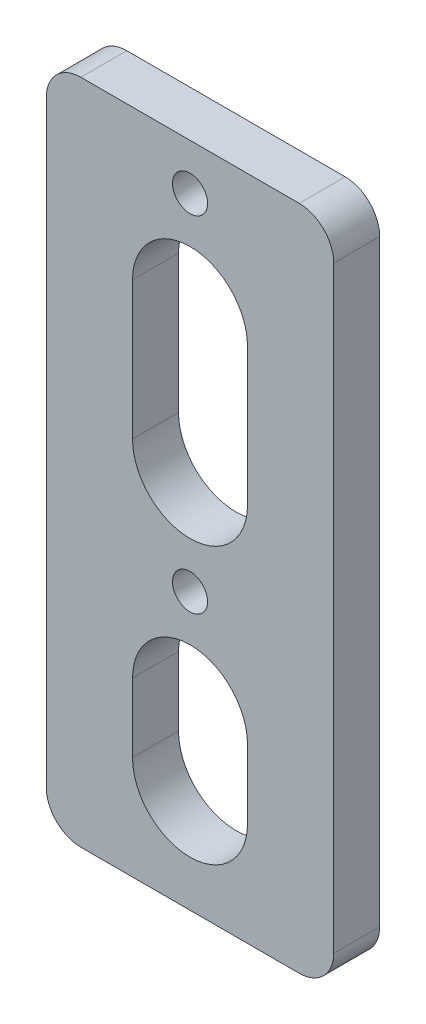
ISO-10303-21;
HEADER;
FILE_DESCRIPTION(('STEP AP214'),'2;1');
FILE_NAME('part.step','',(''),(''),'','','');
FILE_SCHEMA(('AUTOMOTIVE_DESIGN { 1 0 10303 214 1 1 1 1 }'));
ENDSEC;
DATA;
#1=APPLICATION_CONTEXT('core data for automotive mechanical design processes');
#2=APPLICATION_PROTOCOL_DEFINITION('international standard','automotive_design',2000,#1);
#3=PRODUCT_CONTEXT('',#1,'mechanical');
#4=PRODUCT('Part','Part','',(#3));
#5=PRODUCT_RELATED_PRODUCT_CATEGORY('part','',(#4));
#6=PRODUCT_DEFINITION_FORMATION('','',#4);
#7=PRODUCT_DEFINITION_CONTEXT('part definition',#1,'design');
#8=PRODUCT_DEFINITION('design','',#6,#7);
#9=PRODUCT_DEFINITION_SHAPE('','',#8);
#10=(LENGTH_UNIT() NAMED_UNIT(*) SI_UNIT(.MILLI.,.METRE.));
#11=(NAMED_UNIT(*) PLANE_ANGLE_UNIT() SI_UNIT($,.RADIAN.));
#12=(NAMED_UNIT(*) SI_UNIT($,.STERADIAN.) SOLID_ANGLE_UNIT());
#13=UNCERTAINTY_MEASURE_WITH_UNIT(LENGTH_MEASURE(1.E-05),#10,'distance_accuracy_value','');
#14=(GEOMETRIC_REPRESENTATION_CONTEXT(3) GLOBAL_UNCERTAINTY_ASSIGNED_CONTEXT((#13)) GLOBAL_UNIT_ASSIGNED_CONTEXT((#10,
#11,#12)) REPRESENTATION_CONTEXT('',''));
#15=CARTESIAN_POINT('',(0.,0.,0.));
#16=DIRECTION('',(0.,0.,1.));
#17=DIRECTION('',(1.,0.,0.));
#18=AXIS2_PLACEMENT_3D('',#15,#16,#17);
#19=CARTESIAN_POINT('',(12.5,-29.,4.));
#20=DIRECTION('',(-1.,0.,0.));
#21=DIRECTION('',(0.,0.,1.));
#22=AXIS2_PLACEMENT_3D('',#19,#20,#21);
#23=PLANE('',#22);
#24=DIRECTION('',(0.,1.,0.));
#25=VECTOR('',#24,1.);
#26=CARTESIAN_POINT('',(12.5,-29.,4.));
#27=LINE('',#26,#25);
#28=CARTESIAN_POINT('',(12.5,-26.,4.));
#29=VERTEX_POINT('',#28);
#30=CARTESIAN_POINT('',(12.5,26.,4.));
#31=VERTEX_POINT('',#30);
#32=EDGE_CURVE('E231',#29,#31,#27,.T.);
#33=ORIENTED_EDGE('',*,*,#32,.F.);
#34=DIRECTION('',(0.,0.,-1.));
#35=VECTOR('',#34,1.);
#36=CARTESIAN_POINT('',(12.5,-26.,4.));
#37=LINE('',#36,#35);
#38=CARTESIAN_POINT('',(12.5,-26.,0.));
#39=VERTEX_POINT('',#38);
#40=EDGE_CURVE('E256',#29,#39,#37,.T.);
#41=ORIENTED_EDGE('',*,*,#40,.T.);
#42=DIRECTION('',(0.,1.,0.));
#43=VECTOR('',#42,1.);
#44=CARTESIAN_POINT('',(12.5,-29.,0.));
#45=LINE('',#44,#43);
#46=CARTESIAN_POINT('',(12.5,26.,0.));
#47=VERTEX_POINT('',#46);
#48=EDGE_CURVE('E222',#39,#47,#45,.T.);
#49=ORIENTED_EDGE('',*,*,#48,.T.);
#50=DIRECTION('',(0.,0.,-1.));
#51=VECTOR('',#50,1.);
#52=CARTESIAN_POINT('',(12.5,26.,4.));
#53=LINE('',#52,#51);
#54=EDGE_CURVE('E244',#47,#31,#53,.F.);
#55=ORIENTED_EDGE('',*,*,#54,.T.);
#56=EDGE_LOOP('',(#33,#41,#49,#55));
#57=FACE_BOUND('',#56,.T.);
#58=ADVANCED_FACE('F36',(#57),#23,.F.);
#59=CARTESIAN_POINT('',(-12.5,29.,4.));
#60=DIRECTION('',(0.,-1.,0.));
#61=DIRECTION('',(0.,0.,-1.));
#62=AXIS2_PLACEMENT_3D('',#59,#60,#61);
#63=PLANE('',#62);
#64=DIRECTION('',(-1.,0.,0.));
#65=VECTOR('',#64,1.);
#66=CARTESIAN_POINT('',(-12.5,29.,4.));
#67=LINE('',#66,#65);
#68=CARTESIAN_POINT('',(9.5,29.,4.));
#69=VERTEX_POINT('',#68);
#70=CARTESIAN_POINT('',(-9.5,29.,4.));
#71=VERTEX_POINT('',#70);
#72=EDGE_CURVE('E234',#69,#71,#67,.T.);
#73=ORIENTED_EDGE('',*,*,#72,.F.);
#74=DIRECTION('',(0.,0.,-1.));
#75=VECTOR('',#74,1.);
#76=CARTESIAN_POINT('',(9.5,29.,4.));
#77=LINE('',#76,#75);
#78=CARTESIAN_POINT('',(9.5,29.,0.));
#79=VERTEX_POINT('',#78);
#80=EDGE_CURVE('E11',#69,#79,#77,.T.);
#81=ORIENTED_EDGE('',*,*,#80,.T.);
#82=DIRECTION('',(-1.,0.,0.));
#83=VECTOR('',#82,1.);
#84=CARTESIAN_POINT('',(-12.5,29.,0.));
#85=LINE('',#84,#83);
#86=CARTESIAN_POINT('',(-9.5,29.,0.));
#87=VERTEX_POINT('',#86);
#88=EDGE_CURVE('E247',#79,#87,#85,.T.);
#89=ORIENTED_EDGE('',*,*,#88,.T.);
#90=DIRECTION('',(0.,0.,-1.));
#91=VECTOR('',#90,1.);
#92=CARTESIAN_POINT('',(-9.5,29.,4.));
#93=LINE('',#92,#91);
#94=EDGE_CURVE('E44',#87,#71,#93,.F.);
#95=ORIENTED_EDGE('',*,*,#94,.T.);
#96=EDGE_LOOP('',(#73,#81,#89,#95));
#97=FACE_BOUND('',#96,.T.);
#98=ADVANCED_FACE('F287',(#97),#63,.F.);
#99=CARTESIAN_POINT('',(-12.5,-29.,4.));
#100=DIRECTION('',(1.,0.,0.));
#101=DIRECTION('',(0.,0.,-1.));
#102=AXIS2_PLACEMENT_3D('',#99,#100,#101);
#103=PLANE('',#102);
#104=DIRECTION('',(0.,-1.,0.));
#105=VECTOR('',#104,1.);
#106=CARTESIAN_POINT('',(-12.5,-29.,0.));
#107=LINE('',#106,#105);
#108=CARTESIAN_POINT('',(-12.5,26.,0.));
#109=VERTEX_POINT('',#108);
#110=CARTESIAN_POINT('',(-12.5,-26.,0.));
#111=VERTEX_POINT('',#110);
#112=EDGE_CURVE('E250',#109,#111,#107,.T.);
#113=ORIENTED_EDGE('',*,*,#112,.T.);
#114=DIRECTION('',(0.,0.,-1.));
#115=VECTOR('',#114,1.);
#116=CARTESIAN_POINT('',(-12.5,-26.,4.));
#117=LINE('',#116,#115);
#118=CARTESIAN_POINT('',(-12.5,-26.,4.));
#119=VERTEX_POINT('',#118);
#120=EDGE_CURVE('E283',#111,#119,#117,.F.);
#121=ORIENTED_EDGE('',*,*,#120,.T.);
#122=DIRECTION('',(0.,-1.,0.));
#123=VECTOR('',#122,1.);
#124=CARTESIAN_POINT('',(-12.5,-29.,4.));
#125=LINE('',#124,#123);
#126=CARTESIAN_POINT('',(-12.5,26.,4.));
#127=VERTEX_POINT('',#126);
#128=EDGE_CURVE('E238',#127,#119,#125,.T.);
#129=ORIENTED_EDGE('',*,*,#128,.F.);
#130=DIRECTION('',(0.,0.,-1.));
#131=VECTOR('',#130,1.);
#132=CARTESIAN_POINT('',(-12.5,26.,4.));
#133=LINE('',#132,#131);
#134=EDGE_CURVE('E280',#127,#109,#133,.T.);
#135=ORIENTED_EDGE('',*,*,#134,.T.);
#136=EDGE_LOOP('',(#113,#121,#129,#135));
#137=FACE_BOUND('',#136,.T.);
#138=ADVANCED_FACE('F299',(#137),#103,.F.);
#139=CARTESIAN_POINT('',(-12.5,-29.,4.));
#140=DIRECTION('',(0.,1.,0.));
#141=DIRECTION('',(0.,0.,1.));
#142=AXIS2_PLACEMENT_3D('',#139,#140,#141);
#143=PLANE('',#142);
#144=DIRECTION('',(1.,0.,0.));
#145=VECTOR('',#144,1.);
#146=CARTESIAN_POINT('',(-12.5,-29.,0.));
#147=LINE('',#146,#145);
#148=CARTESIAN_POINT('',(-9.5,-29.,0.));
#149=VERTEX_POINT('',#148);
#150=CARTESIAN_POINT('',(9.5,-29.,0.));
#151=VERTEX_POINT('',#150);
#152=EDGE_CURVE('E235',#149,#151,#147,.T.);
#153=ORIENTED_EDGE('',*,*,#152,.T.);
#154=DIRECTION('',(0.,0.,-1.));
#155=VECTOR('',#154,1.);
#156=CARTESIAN_POINT('',(9.5,-29.,4.));
#157=LINE('',#156,#155);
#158=CARTESIAN_POINT('',(9.5,-29.,4.));
#159=VERTEX_POINT('',#158);
#160=EDGE_CURVE('E270',#151,#159,#157,.F.);
#161=ORIENTED_EDGE('',*,*,#160,.T.);
#162=DIRECTION('',(1.,0.,0.));
#163=VECTOR('',#162,1.);
#164=CARTESIAN_POINT('',(-12.5,-29.,4.));
#165=LINE('',#164,#163);
#166=CARTESIAN_POINT('',(-9.5,-29.,4.));
#167=VERTEX_POINT('',#166);
#168=EDGE_CURVE('E241',#167,#159,#165,.T.);
#169=ORIENTED_EDGE('',*,*,#168,.F.);
#170=DIRECTION('',(0.,0.,-1.));
#171=VECTOR('',#170,1.);
#172=CARTESIAN_POINT('',(-9.5,-29.,4.));
#173=LINE('',#172,#171);
#174=EDGE_CURVE('E267',#167,#149,#173,.T.);
#175=ORIENTED_EDGE('',*,*,#174,.T.);
#176=EDGE_LOOP('',(#153,#161,#169,#175));
#177=FACE_BOUND('',#176,.T.);
#178=ADVANCED_FACE('F310',(#177),#143,.F.);
#179=CARTESIAN_POINT('',(0.,0.,4.));
#180=DIRECTION('',(0.,0.,-1.));
#181=DIRECTION('',(-1.,0.,0.));
#182=AXIS2_PLACEMENT_3D('',#179,#180,#181);
#183=PLANE('',#182);
#184=DIRECTION('',(0.,-1.,0.));
#185=VECTOR('',#184,1.);
#186=CARTESIAN_POINT('',(-5.00000000000002,15.9999999994988,4.));
#187=LINE('',#186,#185);
#188=CARTESIAN_POINT('',(-5.00000000000002,15.9999999994988,4.));
#189=VERTEX_POINT('',#188);
#190=CARTESIAN_POINT('',(-5.,3.99999999949883,4.));
#191=VERTEX_POINT('',#190);
#192=EDGE_CURVE('E179',#189,#191,#187,.T.);
#193=ORIENTED_EDGE('',*,*,#192,.F.);
#194=CARTESIAN_POINT('',(0.,15.9999999994988,4.));
#195=DIRECTION('',(0.,0.,1.));
#196=DIRECTION('',(1.,0.,0.));
#197=AXIS2_PLACEMENT_3D('',#194,#195,#196);
#198=CIRCLE('',#197,5.00000000000002);
#199=CARTESIAN_POINT('',(5.00000000000001,15.9999999994988,4.));
#200=VERTEX_POINT('',#199);
#201=EDGE_CURVE('E51',#200,#189,#198,.T.);
#202=ORIENTED_EDGE('',*,*,#201,.F.);
#203=DIRECTION('',(0.,1.,0.));
#204=VECTOR('',#203,1.);
#205=CARTESIAN_POINT('',(5.00000000000001,15.9999999994988,4.));
#206=LINE('',#205,#204);
#207=CARTESIAN_POINT('',(5.00000000000002,3.99999999949883,4.));
#208=VERTEX_POINT('',#207);
#209=EDGE_CURVE('E170',#208,#200,#206,.T.);
#210=ORIENTED_EDGE('',*,*,#209,.F.);
#211=CARTESIAN_POINT('',(0.,3.99999999949883,4.));
#212=DIRECTION('',(0.,0.,1.));
#213=DIRECTION('',(1.,0.,0.));
#214=AXIS2_PLACEMENT_3D('',#211,#212,#213);
#215=CIRCLE('',#214,5.00000000000002);
#216=EDGE_CURVE('E173',#191,#208,#215,.T.);
#217=ORIENTED_EDGE('',*,*,#216,.F.);
#218=EDGE_LOOP('',(#193,#202,#210,#217));
#219=FACE_BOUND('',#218,.T.);
#220=DIRECTION('',(0.,-1.,0.));
#221=VECTOR('',#220,1.);
#222=CARTESIAN_POINT('',(-4.99999999999969,-14.0000000002506,4.));
#223=LINE('',#222,#221);
#224=CARTESIAN_POINT('',(-4.99999999999969,-14.0000000002506,4.));
#225=VERTEX_POINT('',#224);
#226=CARTESIAN_POINT('',(-5.,-20.0000000002506,4.));
#227=VERTEX_POINT('',#226);
#228=EDGE_CURVE('E205',#225,#227,#223,.T.);
#229=ORIENTED_EDGE('',*,*,#228,.F.);
#230=CARTESIAN_POINT('',(-3.10231074483224E-13,-14.0000000002506,4.));
#231=DIRECTION('',(0.,0.,1.));
#232=DIRECTION('',(1.,0.,0.));
#233=AXIS2_PLACEMENT_3D('',#230,#231,#232);
#234=CIRCLE('',#233,4.99999999999969);
#235=CARTESIAN_POINT('',(4.99999999999969,-14.0000000002506,4.));
#236=VERTEX_POINT('',#235);
#237=EDGE_CURVE('E59',#236,#225,#234,.T.);
#238=ORIENTED_EDGE('',*,*,#237,.F.);
#239=DIRECTION('',(0.,1.,0.));
#240=VECTOR('',#239,1.);
#241=CARTESIAN_POINT('',(4.99999999999969,-14.0000000002506,4.));
#242=LINE('',#241,#240);
#243=CARTESIAN_POINT('',(4.99999999999969,-20.0000000002506,4.));
#244=VERTEX_POINT('',#243);
#245=EDGE_CURVE('E194',#244,#236,#242,.T.);
#246=ORIENTED_EDGE('',*,*,#245,.F.);
#247=CARTESIAN_POINT('',(-3.09863680443479E-13,-20.0000000002506,4.));
#248=DIRECTION('',(0.,0.,1.));
#249=DIRECTION('',(1.,0.,0.));
#250=AXIS2_PLACEMENT_3D('',#247,#248,#249);
#251=CIRCLE('',#250,4.99999999999969);
#252=EDGE_CURVE('E208',#227,#244,#251,.T.);
#253=ORIENTED_EDGE('',*,*,#252,.F.);
#254=EDGE_LOOP('',(#229,#238,#246,#253));
#255=FACE_BOUND('',#254,.T.);
#256=CARTESIAN_POINT('',(-2.52887956266378E-12,24.9999999994988,4.));
#257=DIRECTION('',(0.,0.,-1.));
#258=DIRECTION('',(-1.,0.,0.));
#259=AXIS2_PLACEMENT_3D('',#256,#257,#258);
#260=CIRCLE('',#259,1.5250000004891);
#261=CARTESIAN_POINT('',(-1.52500000049163,24.9999999994988,4.));
#262=VERTEX_POINT('',#261);
#263=EDGE_CURVE('E219',#262,#262,#260,.T.);
#264=ORIENTED_EDGE('',*,*,#263,.T.);
#265=EDGE_LOOP('',(#264));
#266=FACE_BOUND('',#265,.T.);
#267=CARTESIAN_POINT('',(-2.53208555920808E-12,-5.00000000050119,4.));
#268=DIRECTION('',(0.,0.,-1.));
#269=DIRECTION('',(-1.,0.,0.));
#270=AXIS2_PLACEMENT_3D('',#267,#268,#269);
#271=CIRCLE('',#270,1.5250000004891);
#272=CARTESIAN_POINT('',(-1.52500000049163,-5.00000000050119,4.));
#273=VERTEX_POINT('',#272);
#274=EDGE_CURVE('E226',#273,#273,#271,.T.);
#275=ORIENTED_EDGE('',*,*,#274,.T.);
#276=EDGE_LOOP('',(#275));
#277=FACE_BOUND('',#276,.T.);
#278=ORIENTED_EDGE('',*,*,#168,.T.);
#279=CARTESIAN_POINT('',(9.5,-26.,4.));
#280=DIRECTION('',(0.,0.,-1.));
#281=DIRECTION('',(-1.,0.,0.));
#282=AXIS2_PLACEMENT_3D('',#279,#280,#281);
#283=CIRCLE('',#282,3.);
#284=EDGE_CURVE('E278',#159,#29,#283,.F.);
#285=ORIENTED_EDGE('',*,*,#284,.T.);
#286=ORIENTED_EDGE('',*,*,#32,.T.);
#287=CARTESIAN_POINT('',(9.5,26.,4.));
#288=DIRECTION('',(0.,0.,-1.));
#289=DIRECTION('',(-1.,0.,0.));
#290=AXIS2_PLACEMENT_3D('',#287,#288,#289);
#291=CIRCLE('',#290,3.);
#292=EDGE_CURVE('E274',#31,#69,#291,.F.);
#293=ORIENTED_EDGE('',*,*,#292,.T.);
#294=ORIENTED_EDGE('',*,*,#72,.T.);
#295=CARTESIAN_POINT('',(-9.5,26.,4.));
#296=DIRECTION('',(0.,0.,-1.));
#297=DIRECTION('',(-1.,0.,0.));
#298=AXIS2_PLACEMENT_3D('',#295,#296,#297);
#299=CIRCLE('',#298,3.);
#300=EDGE_CURVE('E272',#71,#127,#299,.F.);
#301=ORIENTED_EDGE('',*,*,#300,.T.);
#302=ORIENTED_EDGE('',*,*,#128,.T.);
#303=CARTESIAN_POINT('',(-9.5,-26.,4.));
#304=DIRECTION('',(0.,0.,-1.));
#305=DIRECTION('',(-1.,0.,0.));
#306=AXIS2_PLACEMENT_3D('',#303,#304,#305);
#307=CIRCLE('',#306,3.);
#308=EDGE_CURVE('E276',#119,#167,#307,.F.);
#309=ORIENTED_EDGE('',*,*,#308,.T.);
#310=EDGE_LOOP('',(#278,#285,#286,#293,#294,#301,#302,#309));
#311=FACE_BOUND('',#310,.T.);
#312=ADVANCED_FACE('F293',(#219,#255,#266,#277,#311),#183,.F.);
#313=CARTESIAN_POINT('',(0.,0.,0.));
#314=DIRECTION('',(0.,0.,-1.));
#315=DIRECTION('',(-1.,0.,0.));
#316=AXIS2_PLACEMENT_3D('',#313,#314,#315);
#317=PLANE('',#316);
#318=CARTESIAN_POINT('',(0.,15.9999999994988,0.));
#319=DIRECTION('',(0.,0.,1.));
#320=DIRECTION('',(1.,0.,0.));
#321=AXIS2_PLACEMENT_3D('',#318,#319,#320);
#322=CIRCLE('',#321,5.00000000000002);
#323=CARTESIAN_POINT('',(5.00000000000001,15.9999999994988,0.));
#324=VERTEX_POINT('',#323);
#325=CARTESIAN_POINT('',(-5.00000000000002,15.9999999994988,0.));
#326=VERTEX_POINT('',#325);
#327=EDGE_CURVE('E151',#324,#326,#322,.T.);
#328=ORIENTED_EDGE('',*,*,#327,.T.);
#329=DIRECTION('',(0.,-1.,0.));
#330=VECTOR('',#329,1.);
#331=CARTESIAN_POINT('',(-5.00000000000002,15.9999999994988,0.));
#332=LINE('',#331,#330);
#333=CARTESIAN_POINT('',(-5.00000000000002,3.99999999949883,0.));
#334=VERTEX_POINT('',#333);
#335=EDGE_CURVE('E161',#326,#334,#332,.T.);
#336=ORIENTED_EDGE('',*,*,#335,.T.);
#337=CARTESIAN_POINT('',(0.,3.99999999949883,0.));
#338=DIRECTION('',(0.,0.,1.));
#339=DIRECTION('',(1.,0.,0.));
#340=AXIS2_PLACEMENT_3D('',#337,#338,#339);
#341=CIRCLE('',#340,5.00000000000002);
#342=CARTESIAN_POINT('',(5.00000000000002,3.99999999949883,0.));
#343=VERTEX_POINT('',#342);
#344=EDGE_CURVE('E165',#334,#343,#341,.T.);
#345=ORIENTED_EDGE('',*,*,#344,.T.);
#346=DIRECTION('',(0.,1.,0.));
#347=VECTOR('',#346,1.);
#348=CARTESIAN_POINT('',(5.00000000000001,15.9999999994988,0.));
#349=LINE('',#348,#347);
#350=EDGE_CURVE('E157',#343,#324,#349,.T.);
#351=ORIENTED_EDGE('',*,*,#350,.T.);
#352=EDGE_LOOP('',(#328,#336,#345,#351));
#353=FACE_BOUND('',#352,.T.);
#354=CARTESIAN_POINT('',(-3.10231074483224E-13,-14.0000000002506,0.));
#355=DIRECTION('',(0.,0.,1.));
#356=DIRECTION('',(1.,0.,0.));
#357=AXIS2_PLACEMENT_3D('',#354,#355,#356);
#358=CIRCLE('',#357,4.99999999999969);
#359=CARTESIAN_POINT('',(4.99999999999969,-14.0000000002506,0.));
#360=VERTEX_POINT('',#359);
#361=CARTESIAN_POINT('',(-4.99999999999969,-14.0000000002506,0.));
#362=VERTEX_POINT('',#361);
#363=EDGE_CURVE('E190',#360,#362,#358,.T.);
#364=ORIENTED_EDGE('',*,*,#363,.T.);
#365=DIRECTION('',(0.,-1.,0.));
#366=VECTOR('',#365,1.);
#367=CARTESIAN_POINT('',(-4.99999999999969,-14.0000000002506,0.));
#368=LINE('',#367,#366);
#369=CARTESIAN_POINT('',(-4.99999999999969,-20.0000000002506,0.));
#370=VERTEX_POINT('',#369);
#371=EDGE_CURVE('E193',#362,#370,#368,.T.);
#372=ORIENTED_EDGE('',*,*,#371,.T.);
#373=CARTESIAN_POINT('',(-3.09863680443479E-13,-20.0000000002506,0.));
#374=DIRECTION('',(0.,0.,1.));
#375=DIRECTION('',(1.,0.,0.));
#376=AXIS2_PLACEMENT_3D('',#373,#374,#375);
#377=CIRCLE('',#376,4.99999999999969);
#378=CARTESIAN_POINT('',(4.99999999999969,-20.0000000002506,0.));
#379=VERTEX_POINT('',#378);
#380=EDGE_CURVE('E197',#370,#379,#377,.T.);
#381=ORIENTED_EDGE('',*,*,#380,.T.);
#382=DIRECTION('',(0.,1.,0.));
#383=VECTOR('',#382,1.);
#384=CARTESIAN_POINT('',(4.99999999999969,-14.0000000002506,0.));
#385=LINE('',#384,#383);
#386=EDGE_CURVE('E200',#379,#360,#385,.T.);
#387=ORIENTED_EDGE('',*,*,#386,.T.);
#388=EDGE_LOOP('',(#364,#372,#381,#387));
#389=FACE_BOUND('',#388,.T.);
#390=CARTESIAN_POINT('',(-2.52887956266378E-12,24.9999999994988,0.));
#391=DIRECTION('',(0.,0.,-1.));
#392=DIRECTION('',(-1.,0.,0.));
#393=AXIS2_PLACEMENT_3D('',#390,#391,#392);
#394=CIRCLE('',#393,1.5250000004891);
#395=CARTESIAN_POINT('',(-1.52500000049163,24.9999999994988,0.));
#396=VERTEX_POINT('',#395);
#397=EDGE_CURVE('E223',#396,#396,#394,.T.);
#398=ORIENTED_EDGE('',*,*,#397,.F.);
#399=EDGE_LOOP('',(#398));
#400=FACE_BOUND('',#399,.T.);
#401=CARTESIAN_POINT('',(-2.53208555920808E-12,-5.00000000050119,0.));
#402=DIRECTION('',(0.,0.,-1.));
#403=DIRECTION('',(-1.,0.,0.));
#404=AXIS2_PLACEMENT_3D('',#401,#402,#403);
#405=CIRCLE('',#404,1.5250000004891);
#406=CARTESIAN_POINT('',(-1.52500000049163,-5.00000000050119,0.));
#407=VERTEX_POINT('',#406);
#408=EDGE_CURVE('E186',#407,#407,#405,.T.);
#409=ORIENTED_EDGE('',*,*,#408,.F.);
#410=EDGE_LOOP('',(#409));
#411=FACE_BOUND('',#410,.T.);
#412=ORIENTED_EDGE('',*,*,#48,.F.);
#413=CARTESIAN_POINT('',(9.5,-26.,0.));
#414=DIRECTION('',(0.,0.,-1.));
#415=DIRECTION('',(-1.,0.,0.));
#416=AXIS2_PLACEMENT_3D('',#413,#414,#415);
#417=CIRCLE('',#416,3.);
#418=EDGE_CURVE('E265',#39,#151,#417,.T.);
#419=ORIENTED_EDGE('',*,*,#418,.T.);
#420=ORIENTED_EDGE('',*,*,#152,.F.);
#421=CARTESIAN_POINT('',(-9.5,-26.,0.));
#422=DIRECTION('',(0.,0.,-1.));
#423=DIRECTION('',(-1.,0.,0.));
#424=AXIS2_PLACEMENT_3D('',#421,#422,#423);
#425=CIRCLE('',#424,3.);
#426=EDGE_CURVE('E263',#149,#111,#425,.T.);
#427=ORIENTED_EDGE('',*,*,#426,.T.);
#428=ORIENTED_EDGE('',*,*,#112,.F.);
#429=CARTESIAN_POINT('',(-9.5,26.,0.));
#430=DIRECTION('',(0.,0.,-1.));
#431=DIRECTION('',(-1.,0.,0.));
#432=AXIS2_PLACEMENT_3D('',#429,#430,#431);
#433=CIRCLE('',#432,3.);
#434=EDGE_CURVE('E259',#109,#87,#433,.T.);
#435=ORIENTED_EDGE('',*,*,#434,.T.);
#436=ORIENTED_EDGE('',*,*,#88,.F.);
#437=CARTESIAN_POINT('',(9.5,26.,0.));
#438=DIRECTION('',(0.,0.,-1.));
#439=DIRECTION('',(-1.,0.,0.));
#440=AXIS2_PLACEMENT_3D('',#437,#438,#439);
#441=CIRCLE('',#440,3.);
#442=EDGE_CURVE('E261',#79,#47,#441,.T.);
#443=ORIENTED_EDGE('',*,*,#442,.T.);
#444=EDGE_LOOP('',(#412,#419,#420,#427,#428,#435,#436,#443));
#445=FACE_BOUND('',#444,.T.);
#446=ADVANCED_FACE('F167',(#353,#389,#400,#411,#445),#317,.T.);
#447=CARTESIAN_POINT('',(-2.53208555920808E-12,-5.00000000050119,4.));
#448=DIRECTION('',(0.,0.,-1.));
#449=DIRECTION('',(-1.,0.,0.));
#450=AXIS2_PLACEMENT_3D('',#447,#448,#449);
#451=CYLINDRICAL_SURFACE('',#450,1.5250000004891);
#452=ORIENTED_EDGE('',*,*,#274,.F.);
#453=EDGE_LOOP('',(#452));
#454=FACE_BOUND('',#453,.T.);
#455=ORIENTED_EDGE('',*,*,#408,.T.);
#456=EDGE_LOOP('',(#455));
#457=FACE_BOUND('',#456,.T.);
#458=ADVANCED_FACE('F341',(#454,#457),#451,.F.);
#459=CARTESIAN_POINT('',(-2.52887956266378E-12,24.9999999994988,4.));
#460=DIRECTION('',(0.,0.,-1.));
#461=DIRECTION('',(-1.,0.,0.));
#462=AXIS2_PLACEMENT_3D('',#459,#460,#461);
#463=CYLINDRICAL_SURFACE('',#462,1.5250000004891);
#464=ORIENTED_EDGE('',*,*,#263,.F.);
#465=EDGE_LOOP('',(#464));
#466=FACE_BOUND('',#465,.T.);
#467=ORIENTED_EDGE('',*,*,#397,.T.);
#468=EDGE_LOOP('',(#467));
#469=FACE_BOUND('',#468,.T.);
#470=ADVANCED_FACE('F337',(#466,#469),#463,.F.);
#471=CARTESIAN_POINT('',(9.5,-26.,4.));
#472=DIRECTION('',(0.,0.,-1.));
#473=DIRECTION('',(-1.,0.,0.));
#474=AXIS2_PLACEMENT_3D('',#471,#472,#473);
#475=CYLINDRICAL_SURFACE('',#474,3.);
#476=ORIENTED_EDGE('',*,*,#284,.F.);
#477=ORIENTED_EDGE('',*,*,#160,.F.);
#478=ORIENTED_EDGE('',*,*,#418,.F.);
#479=ORIENTED_EDGE('',*,*,#40,.F.);
#480=EDGE_LOOP('',(#476,#477,#478,#479));
#481=FACE_BOUND('',#480,.T.);
#482=ADVANCED_FACE('F316',(#481),#475,.T.);
#483=CARTESIAN_POINT('',(-9.5,-26.,4.));
#484=DIRECTION('',(0.,0.,-1.));
#485=DIRECTION('',(-1.,0.,0.));
#486=AXIS2_PLACEMENT_3D('',#483,#484,#485);
#487=CYLINDRICAL_SURFACE('',#486,3.);
#488=ORIENTED_EDGE('',*,*,#308,.F.);
#489=ORIENTED_EDGE('',*,*,#120,.F.);
#490=ORIENTED_EDGE('',*,*,#426,.F.);
#491=ORIENTED_EDGE('',*,*,#174,.F.);
#492=EDGE_LOOP('',(#488,#489,#490,#491));
#493=FACE_BOUND('',#492,.T.);
#494=ADVANCED_FACE('F307',(#493),#487,.T.);
#495=CARTESIAN_POINT('',(9.5,26.,4.));
#496=DIRECTION('',(0.,0.,-1.));
#497=DIRECTION('',(-1.,0.,0.));
#498=AXIS2_PLACEMENT_3D('',#495,#496,#497);
#499=CYLINDRICAL_SURFACE('',#498,3.);
#500=ORIENTED_EDGE('',*,*,#292,.F.);
#501=ORIENTED_EDGE('',*,*,#54,.F.);
#502=ORIENTED_EDGE('',*,*,#442,.F.);
#503=ORIENTED_EDGE('',*,*,#80,.F.);
#504=EDGE_LOOP('',(#500,#501,#502,#503));
#505=FACE_BOUND('',#504,.T.);
#506=ADVANCED_FACE('F320',(#505),#499,.T.);
#507=CARTESIAN_POINT('',(-9.5,26.,4.));
#508=DIRECTION('',(0.,0.,-1.));
#509=DIRECTION('',(-1.,0.,0.));
#510=AXIS2_PLACEMENT_3D('',#507,#508,#509);
#511=CYLINDRICAL_SURFACE('',#510,3.);
#512=ORIENTED_EDGE('',*,*,#300,.F.);
#513=ORIENTED_EDGE('',*,*,#94,.F.);
#514=ORIENTED_EDGE('',*,*,#434,.F.);
#515=ORIENTED_EDGE('',*,*,#134,.F.);
#516=EDGE_LOOP('',(#512,#513,#514,#515));
#517=FACE_BOUND('',#516,.T.);
#518=ADVANCED_FACE('F38',(#517),#511,.T.);
#519=CARTESIAN_POINT('',(-3.10231074483224E-13,-14.0000000002506,0.));
#520=DIRECTION('',(0.,0.,1.));
#521=DIRECTION('',(1.,0.,0.));
#522=AXIS2_PLACEMENT_3D('',#519,#520,#521);
#523=CYLINDRICAL_SURFACE('',#522,4.99999999999969);
#524=ORIENTED_EDGE('',*,*,#237,.T.);
#525=DIRECTION('',(0.,0.,1.));
#526=VECTOR('',#525,1.);
#527=CARTESIAN_POINT('',(-4.99999999999969,-14.0000000002506,0.));
#528=LINE('',#527,#526);
#529=EDGE_CURVE('E203',#362,#225,#528,.T.);
#530=ORIENTED_EDGE('',*,*,#529,.F.);
#531=ORIENTED_EDGE('',*,*,#363,.F.);
#532=DIRECTION('',(0.,0.,1.));
#533=VECTOR('',#532,1.);
#534=CARTESIAN_POINT('',(4.99999999999969,-14.0000000002506,0.));
#535=LINE('',#534,#533);
#536=EDGE_CURVE('E180',#360,#236,#535,.T.);
#537=ORIENTED_EDGE('',*,*,#536,.T.);
#538=EDGE_LOOP('',(#524,#530,#531,#537));
#539=FACE_BOUND('',#538,.T.);
#540=ADVANCED_FACE('F326',(#539),#523,.F.);
#541=CARTESIAN_POINT('',(4.99999999999969,-14.0000000002506,0.));
#542=DIRECTION('',(1.,0.,0.));
#543=DIRECTION('',(0.,0.,-1.));
#544=AXIS2_PLACEMENT_3D('',#541,#542,#543);
#545=PLANE('',#544);
#546=ORIENTED_EDGE('',*,*,#245,.T.);
#547=ORIENTED_EDGE('',*,*,#536,.F.);
#548=ORIENTED_EDGE('',*,*,#386,.F.);
#549=DIRECTION('',(0.,0.,1.));
#550=VECTOR('',#549,1.);
#551=CARTESIAN_POINT('',(4.99999999999969,-20.0000000002506,0.));
#552=LINE('',#551,#550);
#553=EDGE_CURVE('E214',#379,#244,#552,.T.);
#554=ORIENTED_EDGE('',*,*,#553,.T.);
#555=EDGE_LOOP('',(#546,#547,#548,#554));
#556=FACE_BOUND('',#555,.T.);
#557=ADVANCED_FACE('F429',(#556),#545,.F.);
#558=CARTESIAN_POINT('',(-3.09863680443479E-13,-20.0000000002506,0.));
#559=DIRECTION('',(0.,0.,1.));
#560=DIRECTION('',(1.,0.,0.));
#561=AXIS2_PLACEMENT_3D('',#558,#559,#560);
#562=CYLINDRICAL_SURFACE('',#561,4.99999999999969);
#563=ORIENTED_EDGE('',*,*,#252,.T.);
#564=ORIENTED_EDGE('',*,*,#553,.F.);
#565=ORIENTED_EDGE('',*,*,#380,.F.);
#566=DIRECTION('',(0.,0.,1.));
#567=VECTOR('',#566,1.);
#568=CARTESIAN_POINT('',(-5.,-20.0000000002506,0.));
#569=LINE('',#568,#567);
#570=EDGE_CURVE('E216',#370,#227,#569,.T.);
#571=ORIENTED_EDGE('',*,*,#570,.T.);
#572=EDGE_LOOP('',(#563,#564,#565,#571));
#573=FACE_BOUND('',#572,.T.);
#574=ADVANCED_FACE('F436',(#573),#562,.F.);
#575=CARTESIAN_POINT('',(-4.99999999999969,-14.0000000002506,0.));
#576=DIRECTION('',(-1.,0.,0.));
#577=DIRECTION('',(0.,0.,1.));
#578=AXIS2_PLACEMENT_3D('',#575,#576,#577);
#579=PLANE('',#578);
#580=ORIENTED_EDGE('',*,*,#228,.T.);
#581=ORIENTED_EDGE('',*,*,#570,.F.);
#582=ORIENTED_EDGE('',*,*,#371,.F.);
#583=ORIENTED_EDGE('',*,*,#529,.T.);
#584=EDGE_LOOP('',(#580,#581,#582,#583));
#585=FACE_BOUND('',#584,.T.);
#586=ADVANCED_FACE('F445',(#585),#579,.F.);
#587=CARTESIAN_POINT('',(0.,15.9999999994988,0.));
#588=DIRECTION('',(0.,0.,1.));
#589=DIRECTION('',(1.,0.,0.));
#590=AXIS2_PLACEMENT_3D('',#587,#588,#589);
#591=CYLINDRICAL_SURFACE('',#590,5.00000000000002);
#592=ORIENTED_EDGE('',*,*,#201,.T.);
#593=DIRECTION('',(0.,0.,1.));
#594=VECTOR('',#593,1.);
#595=CARTESIAN_POINT('',(-5.00000000000002,15.9999999994988,0.));
#596=LINE('',#595,#594);
#597=EDGE_CURVE('E147',#326,#189,#596,.T.);
#598=ORIENTED_EDGE('',*,*,#597,.F.);
#599=ORIENTED_EDGE('',*,*,#327,.F.);
#600=DIRECTION('',(0.,0.,1.));
#601=VECTOR('',#600,1.);
#602=CARTESIAN_POINT('',(5.00000000000001,15.9999999994988,0.));
#603=LINE('',#602,#601);
#604=EDGE_CURVE('E184',#324,#200,#603,.T.);
#605=ORIENTED_EDGE('',*,*,#604,.T.);
#606=EDGE_LOOP('',(#592,#598,#599,#605));
#607=FACE_BOUND('',#606,.T.);
#608=ADVANCED_FACE('F149',(#607),#591,.F.);
#609=CARTESIAN_POINT('',(5.00000000000001,15.9999999994988,0.));
#610=DIRECTION('',(1.,0.,0.));
#611=DIRECTION('',(0.,1.,0.));
#612=AXIS2_PLACEMENT_3D('',#609,#610,#611);
#613=PLANE('',#612);
#614=ORIENTED_EDGE('',*,*,#209,.T.);
#615=ORIENTED_EDGE('',*,*,#604,.F.);
#616=ORIENTED_EDGE('',*,*,#350,.F.);
#617=DIRECTION('',(0.,0.,1.));
#618=VECTOR('',#617,1.);
#619=CARTESIAN_POINT('',(5.00000000000002,3.99999999949883,0.));
#620=LINE('',#619,#618);
#621=EDGE_CURVE('E187',#343,#208,#620,.T.);
#622=ORIENTED_EDGE('',*,*,#621,.T.);
#623=EDGE_LOOP('',(#614,#615,#616,#622));
#624=FACE_BOUND('',#623,.T.);
#625=ADVANCED_FACE('F461',(#624),#613,.F.);
#626=CARTESIAN_POINT('',(0.,3.99999999949883,0.));
#627=DIRECTION('',(0.,0.,1.));
#628=DIRECTION('',(1.,0.,0.));
#629=AXIS2_PLACEMENT_3D('',#626,#627,#628);
#630=CYLINDRICAL_SURFACE('',#629,5.00000000000002);
#631=ORIENTED_EDGE('',*,*,#216,.T.);
#632=ORIENTED_EDGE('',*,*,#621,.F.);
#633=ORIENTED_EDGE('',*,*,#344,.F.);
#634=DIRECTION('',(0.,0.,1.));
#635=VECTOR('',#634,1.);
#636=CARTESIAN_POINT('',(-5.,3.99999999949883,0.));
#637=LINE('',#636,#635);
#638=EDGE_CURVE('E156',#334,#191,#637,.T.);
#639=ORIENTED_EDGE('',*,*,#638,.T.);
#640=EDGE_LOOP('',(#631,#632,#633,#639));
#641=FACE_BOUND('',#640,.T.);
#642=ADVANCED_FACE('F469',(#641),#630,.F.);
#643=CARTESIAN_POINT('',(-5.00000000000002,15.9999999994988,0.));
#644=DIRECTION('',(-1.,0.,0.));
#645=DIRECTION('',(0.,-1.,0.));
#646=AXIS2_PLACEMENT_3D('',#643,#644,#645);
#647=PLANE('',#646);
#648=ORIENTED_EDGE('',*,*,#192,.T.);
#649=ORIENTED_EDGE('',*,*,#638,.F.);
#650=ORIENTED_EDGE('',*,*,#335,.F.);
#651=ORIENTED_EDGE('',*,*,#597,.T.);
#652=EDGE_LOOP('',(#648,#649,#650,#651));
#653=FACE_BOUND('',#652,.T.);
#654=ADVANCED_FACE('F162',(#653),#647,.F.);
#655=CLOSED_SHELL('',(#58,#98,#138,#178,#312,#446,#458,#470,#482,#494,#506,#518,#540,#557,#574,
#586,#608,#625,#642,#654));
#656=MANIFOLD_SOLID_BREP('B2',#655);
#657=ADVANCED_BREP_SHAPE_REPRESENTATION('',(#18,#656),#14);
#658=SHAPE_DEFINITION_REPRESENTATION(#9,#657);
ENDSEC;
END-ISO-10303-21;
